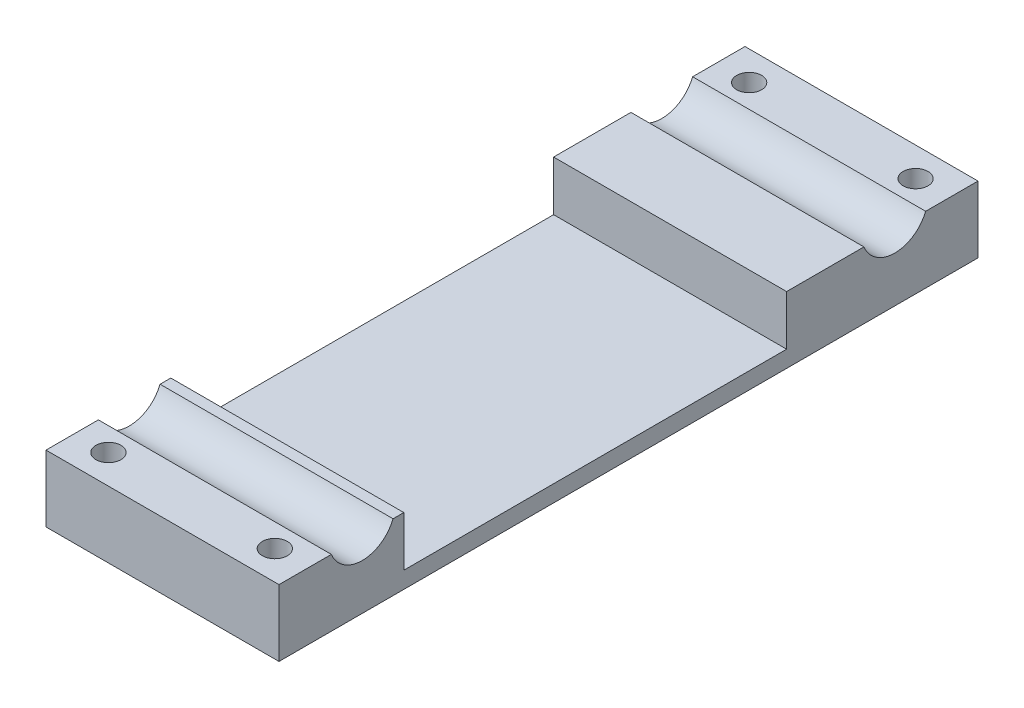
ISO-10303-21;
HEADER;
FILE_DESCRIPTION(('STEP AP214'),'2;1');
FILE_NAME('part.step','',(''),(''),'','','');
FILE_SCHEMA(('AUTOMOTIVE_DESIGN { 1 0 10303 214 1 1 1 1 }'));
ENDSEC;
DATA;
#1=APPLICATION_CONTEXT('core data for automotive mechanical design processes');
#2=APPLICATION_PROTOCOL_DEFINITION('international standard','automotive_design',2000,#1);
#3=PRODUCT_CONTEXT('',#1,'mechanical');
#4=PRODUCT('Part','Part','',(#3));
#5=PRODUCT_RELATED_PRODUCT_CATEGORY('part','',(#4));
#6=PRODUCT_DEFINITION_FORMATION('','',#4);
#7=PRODUCT_DEFINITION_CONTEXT('part definition',#1,'design');
#8=PRODUCT_DEFINITION('design','',#6,#7);
#9=PRODUCT_DEFINITION_SHAPE('','',#8);
#10=(LENGTH_UNIT() NAMED_UNIT(*) SI_UNIT(.MILLI.,.METRE.));
#11=(NAMED_UNIT(*) PLANE_ANGLE_UNIT() SI_UNIT($,.RADIAN.));
#12=(NAMED_UNIT(*) SI_UNIT($,.STERADIAN.) SOLID_ANGLE_UNIT());
#13=UNCERTAINTY_MEASURE_WITH_UNIT(LENGTH_MEASURE(1.E-05),#10,'distance_accuracy_value','');
#14=(GEOMETRIC_REPRESENTATION_CONTEXT(3) GLOBAL_UNCERTAINTY_ASSIGNED_CONTEXT((#13)) GLOBAL_UNIT_ASSIGNED_CONTEXT((#10,
#11,#12)) REPRESENTATION_CONTEXT('',''));
#15=CARTESIAN_POINT('',(0.,0.,0.));
#16=DIRECTION('',(0.,0.,1.));
#17=DIRECTION('',(1.,0.,0.));
#18=AXIS2_PLACEMENT_3D('',#15,#16,#17);
#19=CARTESIAN_POINT('',(0.,12.2426504330451,0.));
#20=DIRECTION('',(0.,1.,0.));
#21=DIRECTION('',(0.,0.,1.));
#22=AXIS2_PLACEMENT_3D('',#19,#20,#21);
#23=PLANE('',#22);
#24=DIRECTION('',(1.,0.,0.));
#25=VECTOR('',#24,1.);
#26=CARTESIAN_POINT('',(-49.2685157734535,12.2426504330451,46.9059490078199));
#27=LINE('',#26,#25);
#28=CARTESIAN_POINT('',(-49.2685157734535,12.2426504330451,46.9059490078199));
#29=VERTEX_POINT('',#28);
#30=CARTESIAN_POINT('',(-21.268515773453,12.2426504330451,46.90594900782));
#31=VERTEX_POINT('',#30);
#32=EDGE_CURVE('E50',#29,#31,#27,.T.);
#33=ORIENTED_EDGE('',*,*,#32,.F.);
#34=DIRECTION('',(0.,0.,-1.));
#35=VECTOR('',#34,1.);
#36=CARTESIAN_POINT('',(-49.2685157734527,12.2426504330451,0.));
#37=LINE('',#36,#35);
#38=CARTESIAN_POINT('',(-49.2685157734527,12.2426504330451,53.1978497642722));
#39=VERTEX_POINT('',#38);
#40=EDGE_CURVE('E190',#39,#29,#37,.T.);
#41=ORIENTED_EDGE('',*,*,#40,.F.);
#42=DIRECTION('',(1.,0.,0.));
#43=VECTOR('',#42,1.);
#44=CARTESIAN_POINT('',(0.,12.2426504330451,53.1978497642722));
#45=LINE('',#44,#43);
#46=CARTESIAN_POINT('',(-21.2685157734527,12.2426504330451,53.1978497642722));
#47=VERTEX_POINT('',#46);
#48=EDGE_CURVE('E143',#39,#47,#45,.T.);
#49=ORIENTED_EDGE('',*,*,#48,.T.);
#50=DIRECTION('',(0.,0.,-1.));
#51=VECTOR('',#50,1.);
#52=CARTESIAN_POINT('',(-21.2685157734528,12.2426504330451,-1.14234761229533E-13));
#53=LINE('',#52,#51);
#54=EDGE_CURVE('E142',#47,#31,#53,.T.);
#55=ORIENTED_EDGE('',*,*,#54,.T.);
#56=EDGE_LOOP('',(#33,#41,#49,#55));
#57=FACE_BOUND('',#56,.T.);
#58=CARTESIAN_POINT('',(-25.2685157734527,12.2426504330451,49.6978497642722));
#59=DIRECTION('',(0.,1.,0.));
#60=DIRECTION('',(0.,0.,1.));
#61=AXIS2_PLACEMENT_3D('',#58,#59,#60);
#62=CIRCLE('',#61,1.49999999999999);
#63=CARTESIAN_POINT('',(-25.2685157734527,12.2426504330451,51.1978497642722));
#64=VERTEX_POINT('',#63);
#65=EDGE_CURVE('E158',#64,#64,#62,.T.);
#66=ORIENTED_EDGE('',*,*,#65,.F.);
#67=EDGE_LOOP('',(#66));
#68=FACE_BOUND('',#67,.T.);
#69=CARTESIAN_POINT('',(-45.2685157734527,12.2426504330451,49.6978497642722));
#70=DIRECTION('',(0.,1.,0.));
#71=DIRECTION('',(0.,0.,1.));
#72=AXIS2_PLACEMENT_3D('',#69,#70,#71);
#73=CIRCLE('',#72,1.5);
#74=CARTESIAN_POINT('',(-45.2685157734527,12.2426504330451,51.1978497642722));
#75=VERTEX_POINT('',#74);
#76=EDGE_CURVE('E152',#75,#75,#73,.T.);
#77=ORIENTED_EDGE('',*,*,#76,.F.);
#78=EDGE_LOOP('',(#77));
#79=FACE_BOUND('',#78,.T.);
#80=ADVANCED_FACE('F35',(#57,#68,#79),#23,.T.);
#81=DIRECTION('',(1.,0.,0.));
#82=VECTOR('',#81,1.);
#83=CARTESIAN_POINT('',(-49.2685157734531,12.2426504330451,-17.0940509921801));
#84=LINE('',#83,#82);
#85=CARTESIAN_POINT('',(-49.2685157734531,12.2426504330451,-17.0940509921801));
#86=VERTEX_POINT('',#85);
#87=CARTESIAN_POINT('',(-21.2685157734527,12.2426504330451,-17.09405099218));
#88=VERTEX_POINT('',#87);
#89=EDGE_CURVE('E11',#86,#88,#84,.T.);
#90=ORIENTED_EDGE('',*,*,#89,.F.);
#91=CARTESIAN_POINT('',(-49.2685157734528,12.2426504330451,-7.80215023572798));
#92=VERTEX_POINT('',#91);
#93=EDGE_CURVE('E182',#92,#86,#37,.T.);
#94=ORIENTED_EDGE('',*,*,#93,.F.);
#95=DIRECTION('',(1.,0.,0.));
#96=VECTOR('',#95,1.);
#97=CARTESIAN_POINT('',(-49.2685157734528,12.2426504330451,-7.80215023572798));
#98=LINE('',#97,#96);
#99=CARTESIAN_POINT('',(-21.2685157734527,12.2426504330451,-7.8021502357279));
#100=VERTEX_POINT('',#99);
#101=EDGE_CURVE('E139',#92,#100,#98,.T.);
#102=ORIENTED_EDGE('',*,*,#101,.T.);
#103=EDGE_CURVE('E133',#100,#88,#53,.T.);
#104=ORIENTED_EDGE('',*,*,#103,.T.);
#105=EDGE_LOOP('',(#90,#94,#102,#104));
#106=FACE_BOUND('',#105,.T.);
#107=ADVANCED_FACE('F138',(#106),#23,.T.);
#108=DIRECTION('',(1.,0.,0.));
#109=VECTOR('',#108,1.);
#110=CARTESIAN_POINT('',(-49.2685157734534,12.2426504330451,39.4897505207242));
#111=LINE('',#110,#109);
#112=CARTESIAN_POINT('',(-21.268515773453,12.2426504330451,39.4897505207243));
#113=VERTEX_POINT('',#112);
#114=CARTESIAN_POINT('',(-49.2685157734534,12.2426504330451,39.4897505207242));
#115=VERTEX_POINT('',#114);
#116=EDGE_CURVE('E214',#113,#115,#111,.F.);
#117=ORIENTED_EDGE('',*,*,#116,.F.);
#118=CARTESIAN_POINT('',(-21.2685157734527,12.2426504330451,38.1978497642722));
#119=VERTEX_POINT('',#118);
#120=EDGE_CURVE('E140',#113,#119,#53,.T.);
#121=ORIENTED_EDGE('',*,*,#120,.T.);
#122=DIRECTION('',(1.,0.,0.));
#123=VECTOR('',#122,1.);
#124=CARTESIAN_POINT('',(-49.2685157734531,12.2426504330451,38.197849764272));
#125=LINE('',#124,#123);
#126=CARTESIAN_POINT('',(-49.2685157734531,12.2426504330451,38.197849764272));
#127=VERTEX_POINT('',#126);
#128=EDGE_CURVE('E227',#127,#119,#125,.T.);
#129=ORIENTED_EDGE('',*,*,#128,.F.);
#130=EDGE_CURVE('E189',#115,#127,#37,.T.);
#131=ORIENTED_EDGE('',*,*,#130,.F.);
#132=EDGE_LOOP('',(#117,#121,#129,#131));
#133=FACE_BOUND('',#132,.T.);
#134=ADVANCED_FACE('F266',(#133),#23,.T.);
#135=CARTESIAN_POINT('',(-49.2685157734527,4.24265043304512,0.));
#136=DIRECTION('',(1.,0.,0.));
#137=DIRECTION('',(0.,0.,-1.));
#138=AXIS2_PLACEMENT_3D('',#135,#136,#137);
#139=PLANE('',#138);
#140=ORIENTED_EDGE('',*,*,#40,.T.);
#141=CARTESIAN_POINT('',(-49.2685157734535,13.7426504330451,43.197849764272));
#142=DIRECTION('',(1.,0.,0.));
#143=DIRECTION('',(0.,0.,-1.));
#144=AXIS2_PLACEMENT_3D('',#141,#142,#143);
#145=CIRCLE('',#144,4.);
#146=EDGE_CURVE('E212',#29,#115,#145,.T.);
#147=ORIENTED_EDGE('',*,*,#146,.T.);
#148=ORIENTED_EDGE('',*,*,#130,.T.);
#149=DIRECTION('',(0.,-1.,0.));
#150=VECTOR('',#149,1.);
#151=CARTESIAN_POINT('',(-49.2685157734531,12.2426504330451,38.197849764272));
#152=LINE('',#151,#150);
#153=CARTESIAN_POINT('',(-49.2685157734531,6.24265043304513,38.197849764272));
#154=VERTEX_POINT('',#153);
#155=EDGE_CURVE('E219',#127,#154,#152,.T.);
#156=ORIENTED_EDGE('',*,*,#155,.T.);
#157=DIRECTION('',(0.,0.,-1.));
#158=VECTOR('',#157,1.);
#159=CARTESIAN_POINT('',(-49.2685157734531,6.24265043304513,38.197849764272));
#160=LINE('',#159,#158);
#161=CARTESIAN_POINT('',(-49.2685157734528,6.24265043304512,-7.80215023572798));
#162=VERTEX_POINT('',#161);
#163=EDGE_CURVE('E221',#154,#162,#160,.T.);
#164=ORIENTED_EDGE('',*,*,#163,.T.);
#165=DIRECTION('',(0.,1.,0.));
#166=VECTOR('',#165,1.);
#167=CARTESIAN_POINT('',(-49.2685157734528,12.2426504330451,-7.80215023572798));
#168=LINE('',#167,#166);
#169=EDGE_CURVE('E224',#162,#92,#168,.T.);
#170=ORIENTED_EDGE('',*,*,#169,.T.);
#171=ORIENTED_EDGE('',*,*,#93,.T.);
#172=CARTESIAN_POINT('',(-49.2685157734531,13.7426504330451,-20.802150235728));
#173=DIRECTION('',(1.,0.,0.));
#174=DIRECTION('',(0.,0.,1.));
#175=AXIS2_PLACEMENT_3D('',#172,#173,#174);
#176=CIRCLE('',#175,4.);
#177=CARTESIAN_POINT('',(-49.2685157734531,12.2426504330451,-24.5102494792758));
#178=VERTEX_POINT('',#177);
#179=EDGE_CURVE('E123',#86,#178,#176,.T.);
#180=ORIENTED_EDGE('',*,*,#179,.T.);
#181=CARTESIAN_POINT('',(-49.2685157734527,12.2426504330451,-30.8021502357278));
#182=VERTEX_POINT('',#181);
#183=EDGE_CURVE('E180',#178,#182,#37,.T.);
#184=ORIENTED_EDGE('',*,*,#183,.T.);
#185=DIRECTION('',(0.,1.,0.));
#186=VECTOR('',#185,1.);
#187=CARTESIAN_POINT('',(-49.2685157734527,4.24265043304512,-30.8021502357278));
#188=LINE('',#187,#186);
#189=CARTESIAN_POINT('',(-49.2685157734527,4.24265043304512,-30.8021502357278));
#190=VERTEX_POINT('',#189);
#191=EDGE_CURVE('E164',#190,#182,#188,.T.);
#192=ORIENTED_EDGE('',*,*,#191,.F.);
#193=DIRECTION('',(0.,0.,-1.));
#194=VECTOR('',#193,1.);
#195=CARTESIAN_POINT('',(-49.2685157734527,4.24265043304512,0.));
#196=LINE('',#195,#194);
#197=CARTESIAN_POINT('',(-49.2685157734527,4.24265043304512,53.1978497642722));
#198=VERTEX_POINT('',#197);
#199=EDGE_CURVE('E245',#198,#190,#196,.T.);
#200=ORIENTED_EDGE('',*,*,#199,.F.);
#201=DIRECTION('',(0.,1.,0.));
#202=VECTOR('',#201,1.);
#203=CARTESIAN_POINT('',(-49.2685157734527,4.24265043304512,53.1978497642722));
#204=LINE('',#203,#202);
#205=EDGE_CURVE('E171',#198,#39,#204,.T.);
#206=ORIENTED_EDGE('',*,*,#205,.T.);
#207=EDGE_LOOP('',(#140,#147,#148,#156,#164,#170,#171,#180,#184,#192,#200,#206));
#208=FACE_BOUND('',#207,.T.);
#209=ADVANCED_FACE('F178',(#208),#139,.F.);
#210=CARTESIAN_POINT('',(0.,4.24265043304512,-30.8021502357278));
#211=DIRECTION('',(0.,0.,1.));
#212=DIRECTION('',(1.,0.,0.));
#213=AXIS2_PLACEMENT_3D('',#210,#211,#212);
#214=PLANE('',#213);
#215=DIRECTION('',(1.,0.,0.));
#216=VECTOR('',#215,1.);
#217=CARTESIAN_POINT('',(0.,12.2426504330451,-30.8021502357278));
#218=LINE('',#217,#216);
#219=CARTESIAN_POINT('',(-21.2685157734527,12.2426504330451,-30.8021502357278));
#220=VERTEX_POINT('',#219);
#221=EDGE_CURVE('E147',#182,#220,#218,.T.);
#222=ORIENTED_EDGE('',*,*,#221,.T.);
#223=DIRECTION('',(0.,1.,0.));
#224=VECTOR('',#223,1.);
#225=CARTESIAN_POINT('',(-21.2685157734527,4.24265043304512,-30.8021502357278));
#226=LINE('',#225,#224);
#227=CARTESIAN_POINT('',(-21.2685157734527,4.24265043304512,-30.8021502357278));
#228=VERTEX_POINT('',#227);
#229=EDGE_CURVE('E167',#228,#220,#226,.T.);
#230=ORIENTED_EDGE('',*,*,#229,.F.);
#231=DIRECTION('',(1.,0.,0.));
#232=VECTOR('',#231,1.);
#233=CARTESIAN_POINT('',(0.,4.24265043304512,-30.8021502357278));
#234=LINE('',#233,#232);
#235=EDGE_CURVE('E251',#190,#228,#234,.T.);
#236=ORIENTED_EDGE('',*,*,#235,.F.);
#237=ORIENTED_EDGE('',*,*,#191,.T.);
#238=EDGE_LOOP('',(#222,#230,#236,#237));
#239=FACE_BOUND('',#238,.T.);
#240=ADVANCED_FACE('F295',(#239),#214,.F.);
#241=CARTESIAN_POINT('',(-21.2685157734528,4.24265043304512,-1.14234761229533E-13));
#242=DIRECTION('',(1.,0.,0.));
#243=DIRECTION('',(0.,0.,-1.));
#244=AXIS2_PLACEMENT_3D('',#241,#242,#243);
#245=PLANE('',#244);
#246=CARTESIAN_POINT('',(-21.268515773453,13.7426504330451,43.1978497642722));
#247=DIRECTION('',(1.,0.,0.));
#248=DIRECTION('',(0.,0.,-1.));
#249=AXIS2_PLACEMENT_3D('',#246,#247,#248);
#250=CIRCLE('',#249,4.);
#251=EDGE_CURVE('E183',#31,#113,#250,.T.);
#252=ORIENTED_EDGE('',*,*,#251,.F.);
#253=ORIENTED_EDGE('',*,*,#54,.F.);
#254=DIRECTION('',(0.,1.,0.));
#255=VECTOR('',#254,1.);
#256=CARTESIAN_POINT('',(-21.2685157734527,4.24265043304512,53.1978497642722));
#257=LINE('',#256,#255);
#258=CARTESIAN_POINT('',(-21.2685157734527,4.24265043304512,53.1978497642722));
#259=VERTEX_POINT('',#258);
#260=EDGE_CURVE('E169',#259,#47,#257,.T.);
#261=ORIENTED_EDGE('',*,*,#260,.F.);
#262=DIRECTION('',(0.,0.,-1.));
#263=VECTOR('',#262,1.);
#264=CARTESIAN_POINT('',(-21.2685157734528,4.24265043304512,-1.14234761229533E-13));
#265=LINE('',#264,#263);
#266=EDGE_CURVE('E249',#259,#228,#265,.T.);
#267=ORIENTED_EDGE('',*,*,#266,.T.);
#268=ORIENTED_EDGE('',*,*,#229,.T.);
#269=CARTESIAN_POINT('',(-21.2685157734526,12.2426504330451,-24.5102494792757));
#270=VERTEX_POINT('',#269);
#271=EDGE_CURVE('E135',#270,#220,#53,.T.);
#272=ORIENTED_EDGE('',*,*,#271,.F.);
#273=CARTESIAN_POINT('',(-21.2685157734527,13.7426504330451,-20.8021502357278));
#274=DIRECTION('',(1.,0.,0.));
#275=DIRECTION('',(0.,0.,1.));
#276=AXIS2_PLACEMENT_3D('',#273,#274,#275);
#277=CIRCLE('',#276,4.);
#278=EDGE_CURVE('E57',#88,#270,#277,.T.);
#279=ORIENTED_EDGE('',*,*,#278,.F.);
#280=ORIENTED_EDGE('',*,*,#103,.F.);
#281=DIRECTION('',(0.,1.,0.));
#282=VECTOR('',#281,1.);
#283=CARTESIAN_POINT('',(-21.2685157734527,4.24265043304513,-7.80215023572783));
#284=LINE('',#283,#282);
#285=CARTESIAN_POINT('',(-21.2685157734529,6.24265043304512,-7.80215023572783));
#286=VERTEX_POINT('',#285);
#287=EDGE_CURVE('E230',#286,#100,#284,.T.);
#288=ORIENTED_EDGE('',*,*,#287,.F.);
#289=DIRECTION('',(0.,0.,-1.));
#290=VECTOR('',#289,1.);
#291=CARTESIAN_POINT('',(-21.2685157734528,6.24265043304512,-1.14272472609446E-13));
#292=LINE('',#291,#290);
#293=CARTESIAN_POINT('',(-21.2685157734529,6.24265043304513,38.1978497642722));
#294=VERTEX_POINT('',#293);
#295=EDGE_CURVE('E166',#294,#286,#292,.T.);
#296=ORIENTED_EDGE('',*,*,#295,.F.);
#297=DIRECTION('',(0.,-1.,0.));
#298=VECTOR('',#297,1.);
#299=CARTESIAN_POINT('',(-21.268515773453,4.24265043304517,38.1978497642722));
#300=LINE('',#299,#298);
#301=EDGE_CURVE('E238',#119,#294,#300,.T.);
#302=ORIENTED_EDGE('',*,*,#301,.F.);
#303=ORIENTED_EDGE('',*,*,#120,.F.);
#304=EDGE_LOOP('',(#252,#253,#261,#267,#268,#272,#279,#280,#288,#296,#302,#303));
#305=FACE_BOUND('',#304,.T.);
#306=ADVANCED_FACE('F131',(#305),#245,.T.);
#307=CARTESIAN_POINT('',(-45.2685157734527,4.24265043304512,49.6978497642722));
#308=DIRECTION('',(0.,1.,0.));
#309=DIRECTION('',(0.,0.,1.));
#310=AXIS2_PLACEMENT_3D('',#307,#308,#309);
#311=CYLINDRICAL_SURFACE('',#310,1.5);
#312=CARTESIAN_POINT('',(-45.2685157734527,4.24265043304512,49.6978497642722));
#313=DIRECTION('',(0.,1.,0.));
#314=DIRECTION('',(0.,0.,1.));
#315=AXIS2_PLACEMENT_3D('',#312,#313,#314);
#316=CIRCLE('',#315,1.5);
#317=CARTESIAN_POINT('',(-45.2685157734527,4.24265043304512,51.1978497642722));
#318=VERTEX_POINT('',#317);
#319=EDGE_CURVE('E253',#318,#318,#316,.T.);
#320=ORIENTED_EDGE('',*,*,#319,.F.);
#321=EDGE_LOOP('',(#320));
#322=FACE_BOUND('',#321,.T.);
#323=ORIENTED_EDGE('',*,*,#76,.T.);
#324=EDGE_LOOP('',(#323));
#325=FACE_BOUND('',#324,.T.);
#326=ADVANCED_FACE('F278',(#322,#325),#311,.F.);
#327=CARTESIAN_POINT('',(0.,4.24265043304512,53.1978497642722));
#328=DIRECTION('',(0.,0.,1.));
#329=DIRECTION('',(1.,0.,0.));
#330=AXIS2_PLACEMENT_3D('',#327,#328,#329);
#331=PLANE('',#330);
#332=ORIENTED_EDGE('',*,*,#48,.F.);
#333=ORIENTED_EDGE('',*,*,#205,.F.);
#334=DIRECTION('',(1.,0.,0.));
#335=VECTOR('',#334,1.);
#336=CARTESIAN_POINT('',(0.,4.24265043304512,53.1978497642722));
#337=LINE('',#336,#335);
#338=EDGE_CURVE('E206',#198,#259,#337,.T.);
#339=ORIENTED_EDGE('',*,*,#338,.T.);
#340=ORIENTED_EDGE('',*,*,#260,.T.);
#341=EDGE_LOOP('',(#332,#333,#339,#340));
#342=FACE_BOUND('',#341,.T.);
#343=ADVANCED_FACE('F202',(#342),#331,.T.);
#344=CARTESIAN_POINT('',(-25.2685157734527,4.24265043304512,-27.3021502357278));
#345=DIRECTION('',(0.,1.,0.));
#346=DIRECTION('',(0.,0.,1.));
#347=AXIS2_PLACEMENT_3D('',#344,#345,#346);
#348=CYLINDRICAL_SURFACE('',#347,1.5);
#349=CARTESIAN_POINT('',(-25.2685157734527,4.24265043304512,-27.3021502357278));
#350=DIRECTION('',(0.,1.,0.));
#351=DIRECTION('',(0.,0.,1.));
#352=AXIS2_PLACEMENT_3D('',#349,#350,#351);
#353=CIRCLE('',#352,1.5);
#354=CARTESIAN_POINT('',(-25.2685157734527,4.24265043304512,-25.8021502357278));
#355=VERTEX_POINT('',#354);
#356=EDGE_CURVE('E242',#355,#355,#353,.T.);
#357=ORIENTED_EDGE('',*,*,#356,.F.);
#358=EDGE_LOOP('',(#357));
#359=FACE_BOUND('',#358,.T.);
#360=CARTESIAN_POINT('',(-25.2685157734527,12.2426504330451,-27.3021502357278));
#361=DIRECTION('',(0.,1.,0.));
#362=DIRECTION('',(0.,0.,1.));
#363=AXIS2_PLACEMENT_3D('',#360,#361,#362);
#364=CIRCLE('',#363,1.5);
#365=CARTESIAN_POINT('',(-25.2685157734527,12.2426504330451,-25.8021502357278));
#366=VERTEX_POINT('',#365);
#367=EDGE_CURVE('E187',#366,#366,#364,.T.);
#368=ORIENTED_EDGE('',*,*,#367,.T.);
#369=EDGE_LOOP('',(#368));
#370=FACE_BOUND('',#369,.T.);
#371=ADVANCED_FACE('F269',(#359,#370),#348,.F.);
#372=CARTESIAN_POINT('',(-45.2685157734527,4.24265043304512,-27.3021502357278));
#373=DIRECTION('',(0.,1.,0.));
#374=DIRECTION('',(0.,0.,1.));
#375=AXIS2_PLACEMENT_3D('',#372,#373,#374);
#376=CYLINDRICAL_SURFACE('',#375,1.5);
#377=CARTESIAN_POINT('',(-45.2685157734527,4.24265043304512,-27.3021502357278));
#378=DIRECTION('',(0.,1.,0.));
#379=DIRECTION('',(0.,0.,1.));
#380=AXIS2_PLACEMENT_3D('',#377,#378,#379);
#381=CIRCLE('',#380,1.5);
#382=CARTESIAN_POINT('',(-45.2685157734527,4.24265043304512,-25.8021502357278));
#383=VERTEX_POINT('',#382);
#384=EDGE_CURVE('E163',#383,#383,#381,.T.);
#385=ORIENTED_EDGE('',*,*,#384,.F.);
#386=EDGE_LOOP('',(#385));
#387=FACE_BOUND('',#386,.T.);
#388=CARTESIAN_POINT('',(-45.2685157734527,12.2426504330451,-27.3021502357278));
#389=DIRECTION('',(0.,1.,0.));
#390=DIRECTION('',(0.,0.,1.));
#391=AXIS2_PLACEMENT_3D('',#388,#389,#390);
#392=CIRCLE('',#391,1.5);
#393=CARTESIAN_POINT('',(-45.2685157734527,12.2426504330451,-25.8021502357278));
#394=VERTEX_POINT('',#393);
#395=EDGE_CURVE('E192',#394,#394,#392,.T.);
#396=ORIENTED_EDGE('',*,*,#395,.T.);
#397=EDGE_LOOP('',(#396));
#398=FACE_BOUND('',#397,.T.);
#399=ADVANCED_FACE('F37',(#387,#398),#376,.F.);
#400=CARTESIAN_POINT('',(-25.2685157734527,4.24265043304512,49.6978497642722));
#401=DIRECTION('',(0.,1.,0.));
#402=DIRECTION('',(0.,0.,1.));
#403=AXIS2_PLACEMENT_3D('',#400,#401,#402);
#404=CYLINDRICAL_SURFACE('',#403,1.49999999999999);
#405=CARTESIAN_POINT('',(-25.2685157734527,4.24265043304512,49.6978497642722));
#406=DIRECTION('',(0.,1.,0.));
#407=DIRECTION('',(0.,0.,1.));
#408=AXIS2_PLACEMENT_3D('',#405,#406,#407);
#409=CIRCLE('',#408,1.49999999999999);
#410=CARTESIAN_POINT('',(-25.2685157734527,4.24265043304512,51.1978497642722));
#411=VERTEX_POINT('',#410);
#412=EDGE_CURVE('E173',#411,#411,#409,.T.);
#413=ORIENTED_EDGE('',*,*,#412,.F.);
#414=EDGE_LOOP('',(#413));
#415=FACE_BOUND('',#414,.T.);
#416=ORIENTED_EDGE('',*,*,#65,.T.);
#417=EDGE_LOOP('',(#416));
#418=FACE_BOUND('',#417,.T.);
#419=ADVANCED_FACE('F276',(#415,#418),#404,.F.);
#420=CARTESIAN_POINT('',(0.,4.24265043304512,0.));
#421=DIRECTION('',(0.,1.,0.));
#422=DIRECTION('',(0.,0.,1.));
#423=AXIS2_PLACEMENT_3D('',#420,#421,#422);
#424=PLANE('',#423);
#425=ORIENTED_EDGE('',*,*,#384,.T.);
#426=EDGE_LOOP('',(#425));
#427=FACE_BOUND('',#426,.T.);
#428=ORIENTED_EDGE('',*,*,#356,.T.);
#429=EDGE_LOOP('',(#428));
#430=FACE_BOUND('',#429,.T.);
#431=ORIENTED_EDGE('',*,*,#199,.T.);
#432=ORIENTED_EDGE('',*,*,#235,.T.);
#433=ORIENTED_EDGE('',*,*,#266,.F.);
#434=ORIENTED_EDGE('',*,*,#338,.F.);
#435=EDGE_LOOP('',(#431,#432,#433,#434));
#436=FACE_BOUND('',#435,.T.);
#437=ORIENTED_EDGE('',*,*,#319,.T.);
#438=EDGE_LOOP('',(#437));
#439=FACE_BOUND('',#438,.T.);
#440=ORIENTED_EDGE('',*,*,#412,.T.);
#441=EDGE_LOOP('',(#440));
#442=FACE_BOUND('',#441,.T.);
#443=ADVANCED_FACE('F264',(#427,#430,#436,#439,#442),#424,.F.);
#444=DIRECTION('',(1.,0.,0.));
#445=VECTOR('',#444,1.);
#446=CARTESIAN_POINT('',(-49.2685157734531,12.2426504330451,-24.5102494792758));
#447=LINE('',#446,#445);
#448=EDGE_CURVE('E43',#270,#178,#447,.F.);
#449=ORIENTED_EDGE('',*,*,#448,.F.);
#450=ORIENTED_EDGE('',*,*,#271,.T.);
#451=ORIENTED_EDGE('',*,*,#221,.F.);
#452=ORIENTED_EDGE('',*,*,#183,.F.);
#453=EDGE_LOOP('',(#449,#450,#451,#452));
#454=FACE_BOUND('',#453,.T.);
#455=ORIENTED_EDGE('',*,*,#395,.F.);
#456=EDGE_LOOP('',(#455));
#457=FACE_BOUND('',#456,.T.);
#458=ORIENTED_EDGE('',*,*,#367,.F.);
#459=EDGE_LOOP('',(#458));
#460=FACE_BOUND('',#459,.T.);
#461=ADVANCED_FACE('F185',(#454,#457,#460),#23,.T.);
#462=CARTESIAN_POINT('',(-49.2685157734531,12.2426504330451,38.197849764272));
#463=DIRECTION('',(0.,0.,1.));
#464=DIRECTION('',(1.,0.,0.));
#465=AXIS2_PLACEMENT_3D('',#462,#463,#464);
#466=PLANE('',#465);
#467=ORIENTED_EDGE('',*,*,#301,.T.);
#468=DIRECTION('',(1.,0.,0.));
#469=VECTOR('',#468,1.);
#470=CARTESIAN_POINT('',(-49.2685157734531,6.24265043304513,38.197849764272));
#471=LINE('',#470,#469);
#472=EDGE_CURVE('E226',#154,#294,#471,.T.);
#473=ORIENTED_EDGE('',*,*,#472,.F.);
#474=ORIENTED_EDGE('',*,*,#155,.F.);
#475=ORIENTED_EDGE('',*,*,#128,.T.);
#476=EDGE_LOOP('',(#467,#473,#474,#475));
#477=FACE_BOUND('',#476,.T.);
#478=ADVANCED_FACE('F263',(#477),#466,.F.);
#479=CARTESIAN_POINT('',(-49.2685157734528,12.2426504330451,-7.80215023572798));
#480=DIRECTION('',(0.,0.,-1.));
#481=DIRECTION('',(-1.,0.,0.));
#482=AXIS2_PLACEMENT_3D('',#479,#480,#481);
#483=PLANE('',#482);
#484=ORIENTED_EDGE('',*,*,#287,.T.);
#485=ORIENTED_EDGE('',*,*,#101,.F.);
#486=ORIENTED_EDGE('',*,*,#169,.F.);
#487=DIRECTION('',(1.,0.,0.));
#488=VECTOR('',#487,1.);
#489=CARTESIAN_POINT('',(-49.2685157734528,6.24265043304512,-7.80215023572798));
#490=LINE('',#489,#488);
#491=EDGE_CURVE('E232',#162,#286,#490,.T.);
#492=ORIENTED_EDGE('',*,*,#491,.T.);
#493=EDGE_LOOP('',(#484,#485,#486,#492));
#494=FACE_BOUND('',#493,.T.);
#495=ADVANCED_FACE('F316',(#494),#483,.F.);
#496=CARTESIAN_POINT('',(-49.2685157734531,6.24265043304513,38.197849764272));
#497=DIRECTION('',(0.,-1.,0.));
#498=DIRECTION('',(0.,0.,-1.));
#499=AXIS2_PLACEMENT_3D('',#496,#497,#498);
#500=PLANE('',#499);
#501=ORIENTED_EDGE('',*,*,#295,.T.);
#502=ORIENTED_EDGE('',*,*,#491,.F.);
#503=ORIENTED_EDGE('',*,*,#163,.F.);
#504=ORIENTED_EDGE('',*,*,#472,.T.);
#505=EDGE_LOOP('',(#501,#502,#503,#504));
#506=FACE_BOUND('',#505,.T.);
#507=ADVANCED_FACE('F313',(#506),#500,.F.);
#508=CARTESIAN_POINT('',(-49.2685157734531,13.7426504330451,-20.802150235728));
#509=DIRECTION('',(1.,0.,0.));
#510=DIRECTION('',(0.,0.,-1.));
#511=AXIS2_PLACEMENT_3D('',#508,#509,#510);
#512=CYLINDRICAL_SURFACE('',#511,4.);
#513=ORIENTED_EDGE('',*,*,#89,.T.);
#514=ORIENTED_EDGE('',*,*,#278,.T.);
#515=ORIENTED_EDGE('',*,*,#448,.T.);
#516=ORIENTED_EDGE('',*,*,#179,.F.);
#517=EDGE_LOOP('',(#513,#514,#515,#516));
#518=FACE_BOUND('',#517,.T.);
#519=ADVANCED_FACE('F121',(#518),#512,.F.);
#520=CARTESIAN_POINT('',(-49.2685157734535,13.7426504330451,43.197849764272));
#521=DIRECTION('',(1.,0.,0.));
#522=DIRECTION('',(0.,0.,-1.));
#523=AXIS2_PLACEMENT_3D('',#520,#521,#522);
#524=CYLINDRICAL_SURFACE('',#523,4.);
#525=ORIENTED_EDGE('',*,*,#32,.T.);
#526=ORIENTED_EDGE('',*,*,#251,.T.);
#527=ORIENTED_EDGE('',*,*,#116,.T.);
#528=ORIENTED_EDGE('',*,*,#146,.F.);
#529=EDGE_LOOP('',(#525,#526,#527,#528));
#530=FACE_BOUND('',#529,.T.);
#531=ADVANCED_FACE('F307',(#530),#524,.F.);
#532=CLOSED_SHELL('',(#80,#107,#134,#209,#240,#306,#326,#343,#371,#399,#419,#443,#461,#478,#495,
#507,#519,#531));
#533=MANIFOLD_SOLID_BREP('B2',#532);
#534=ADVANCED_BREP_SHAPE_REPRESENTATION('',(#18,#533),#14);
#535=SHAPE_DEFINITION_REPRESENTATION(#9,#534);
ENDSEC;
END-ISO-10303-21;
